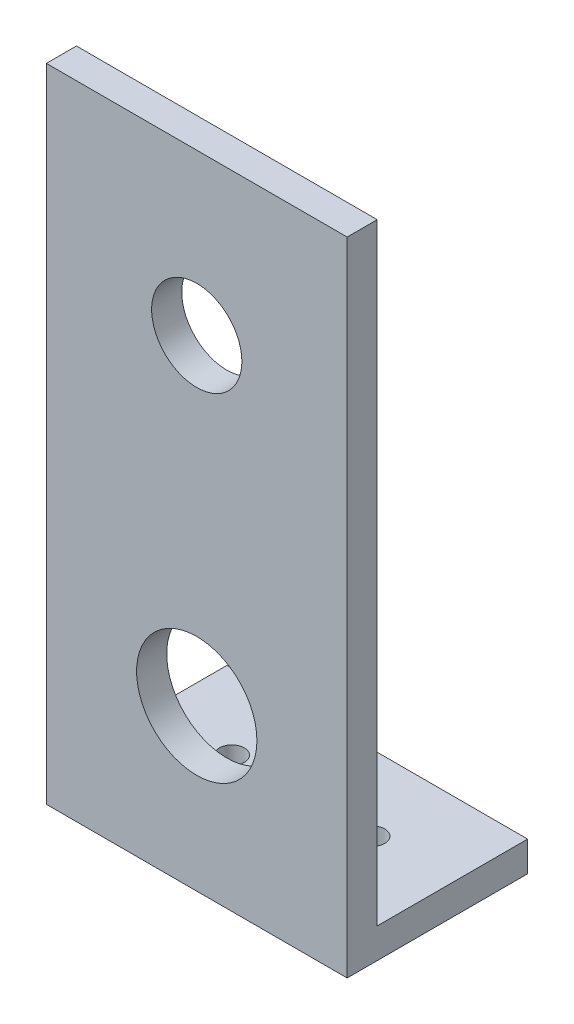
ISO-10303-21;
HEADER;
FILE_DESCRIPTION(('STEP AP214'),'2;1');
FILE_NAME('part.step','',(''),(''),'','','');
FILE_SCHEMA(('AUTOMOTIVE_DESIGN { 1 0 10303 214 1 1 1 1 }'));
ENDSEC;
DATA;
#1=APPLICATION_CONTEXT('core data for automotive mechanical design processes');
#2=APPLICATION_PROTOCOL_DEFINITION('international standard','automotive_design',2000,#1);
#3=PRODUCT_CONTEXT('',#1,'mechanical');
#4=PRODUCT('Part','Part','',(#3));
#5=PRODUCT_RELATED_PRODUCT_CATEGORY('part','',(#4));
#6=PRODUCT_DEFINITION_FORMATION('','',#4);
#7=PRODUCT_DEFINITION_CONTEXT('part definition',#1,'design');
#8=PRODUCT_DEFINITION('design','',#6,#7);
#9=PRODUCT_DEFINITION_SHAPE('','',#8);
#10=(LENGTH_UNIT() NAMED_UNIT(*) SI_UNIT(.MILLI.,.METRE.));
#11=(NAMED_UNIT(*) PLANE_ANGLE_UNIT() SI_UNIT($,.RADIAN.));
#12=(NAMED_UNIT(*) SI_UNIT($,.STERADIAN.) SOLID_ANGLE_UNIT());
#13=UNCERTAINTY_MEASURE_WITH_UNIT(LENGTH_MEASURE(1.E-05),#10,'distance_accuracy_value','');
#14=(GEOMETRIC_REPRESENTATION_CONTEXT(3) GLOBAL_UNCERTAINTY_ASSIGNED_CONTEXT((#13)) GLOBAL_UNIT_ASSIGNED_CONTEXT((#10,
#11,#12)) REPRESENTATION_CONTEXT('',''));
#15=CARTESIAN_POINT('',(0.,0.,0.));
#16=DIRECTION('',(0.,0.,1.));
#17=DIRECTION('',(1.,0.,0.));
#18=AXIS2_PLACEMENT_3D('',#15,#16,#17);
#19=CARTESIAN_POINT('',(-31.8013727121464,-25.7813597707525,3.));
#20=DIRECTION('',(1.,0.,0.));
#21=DIRECTION('',(0.,0.,-1.));
#22=AXIS2_PLACEMENT_3D('',#19,#20,#21);
#23=PLANE('',#22);
#24=DIRECTION('',(0.,-1.,0.));
#25=VECTOR('',#24,1.);
#26=CARTESIAN_POINT('',(-31.8013727121464,-25.7813597707525,0.));
#27=LINE('',#26,#25);
#28=CARTESIAN_POINT('',(-31.8013727121464,38.2186402292475,0.));
#29=VERTEX_POINT('',#28);
#30=CARTESIAN_POINT('',(-31.8013727121464,-22.7813597707525,0.));
#31=VERTEX_POINT('',#30);
#32=EDGE_CURVE('E150',#29,#31,#27,.T.);
#33=ORIENTED_EDGE('',*,*,#32,.T.);
#34=DIRECTION('',(0.,0.,1.));
#35=VECTOR('',#34,1.);
#36=CARTESIAN_POINT('',(-31.8013727121464,-22.7813597707525,-15.));
#37=LINE('',#36,#35);
#38=CARTESIAN_POINT('',(-31.8013727121464,-22.7813597707525,-15.));
#39=VERTEX_POINT('',#38);
#40=EDGE_CURVE('E135',#39,#31,#37,.T.);
#41=ORIENTED_EDGE('',*,*,#40,.F.);
#42=DIRECTION('',(0.,1.,0.));
#43=VECTOR('',#42,1.);
#44=CARTESIAN_POINT('',(-31.8013727121464,-25.7813597707525,-15.));
#45=LINE('',#44,#43);
#46=CARTESIAN_POINT('',(-31.8013727121464,-25.7813597707525,-15.));
#47=VERTEX_POINT('',#46);
#48=EDGE_CURVE('E110',#47,#39,#45,.T.);
#49=ORIENTED_EDGE('',*,*,#48,.F.);
#50=DIRECTION('',(0.,0.,-1.));
#51=VECTOR('',#50,1.);
#52=CARTESIAN_POINT('',(-31.8013727121464,-25.7813597707525,3.));
#53=LINE('',#52,#51);
#54=CARTESIAN_POINT('',(-31.8013727121464,-25.7813597707525,3.));
#55=VERTEX_POINT('',#54);
#56=EDGE_CURVE('E11',#55,#47,#53,.T.);
#57=ORIENTED_EDGE('',*,*,#56,.F.);
#58=DIRECTION('',(0.,-1.,0.));
#59=VECTOR('',#58,1.);
#60=CARTESIAN_POINT('',(-31.8013727121464,-25.7813597707525,3.));
#61=LINE('',#60,#59);
#62=CARTESIAN_POINT('',(-31.8013727121464,38.2186402292475,3.));
#63=VERTEX_POINT('',#62);
#64=EDGE_CURVE('E153',#63,#55,#61,.T.);
#65=ORIENTED_EDGE('',*,*,#64,.F.);
#66=DIRECTION('',(0.,0.,-1.));
#67=VECTOR('',#66,1.);
#68=CARTESIAN_POINT('',(-31.8013727121464,38.2186402292475,3.));
#69=LINE('',#68,#67);
#70=EDGE_CURVE('E158',#63,#29,#69,.T.);
#71=ORIENTED_EDGE('',*,*,#70,.T.);
#72=EDGE_LOOP('',(#33,#41,#49,#57,#65,#71));
#73=FACE_BOUND('',#72,.T.);
#74=ADVANCED_FACE('F32',(#73),#23,.F.);
#75=CARTESIAN_POINT('',(-31.8013727121464,-25.7813597707525,3.));
#76=DIRECTION('',(0.,1.,0.));
#77=DIRECTION('',(0.,0.,1.));
#78=AXIS2_PLACEMENT_3D('',#75,#76,#77);
#79=PLANE('',#78);
#80=CARTESIAN_POINT('',(-23.8013727121464,-25.7813597707525,-7.5));
#81=DIRECTION('',(0.,1.,0.));
#82=DIRECTION('',(0.,0.,1.));
#83=AXIS2_PLACEMENT_3D('',#80,#81,#82);
#84=CIRCLE('',#83,1.25);
#85=CARTESIAN_POINT('',(-23.8013727121464,-25.7813597707525,-6.25));
#86=VERTEX_POINT('',#85);
#87=EDGE_CURVE('E194',#86,#86,#84,.T.);
#88=ORIENTED_EDGE('',*,*,#87,.T.);
#89=EDGE_LOOP('',(#88));
#90=FACE_BOUND('',#89,.T.);
#91=CARTESIAN_POINT('',(-9.80137271214645,-25.7813597707525,-7.5));
#92=DIRECTION('',(0.,1.,0.));
#93=DIRECTION('',(0.,0.,1.));
#94=AXIS2_PLACEMENT_3D('',#91,#92,#93);
#95=CIRCLE('',#94,1.25);
#96=CARTESIAN_POINT('',(-9.80137271214645,-25.7813597707525,-6.25));
#97=VERTEX_POINT('',#96);
#98=EDGE_CURVE('E117',#97,#97,#95,.T.);
#99=ORIENTED_EDGE('',*,*,#98,.T.);
#100=EDGE_LOOP('',(#99));
#101=FACE_BOUND('',#100,.T.);
#102=ORIENTED_EDGE('',*,*,#56,.T.);
#103=DIRECTION('',(-1.,0.,0.));
#104=VECTOR('',#103,1.);
#105=CARTESIAN_POINT('',(-1.80137271214645,-25.7813597707525,-15.));
#106=LINE('',#105,#104);
#107=CARTESIAN_POINT('',(-1.80137271214645,-25.7813597707525,-15.));
#108=VERTEX_POINT('',#107);
#109=EDGE_CURVE('E105',#108,#47,#106,.T.);
#110=ORIENTED_EDGE('',*,*,#109,.F.);
#111=DIRECTION('',(0.,0.,-1.));
#112=VECTOR('',#111,1.);
#113=CARTESIAN_POINT('',(-1.80137271214645,-25.7813597707525,3.));
#114=LINE('',#113,#112);
#115=CARTESIAN_POINT('',(-1.80137271214645,-25.7813597707525,3.));
#116=VERTEX_POINT('',#115);
#117=EDGE_CURVE('E40',#116,#108,#114,.T.);
#118=ORIENTED_EDGE('',*,*,#117,.F.);
#119=DIRECTION('',(1.,0.,0.));
#120=VECTOR('',#119,1.);
#121=CARTESIAN_POINT('',(-31.8013727121464,-25.7813597707525,3.));
#122=LINE('',#121,#120);
#123=EDGE_CURVE('E79',#55,#116,#122,.T.);
#124=ORIENTED_EDGE('',*,*,#123,.F.);
#125=EDGE_LOOP('',(#102,#110,#118,#124));
#126=FACE_BOUND('',#125,.T.);
#127=ADVANCED_FACE('F106',(#90,#101,#126),#79,.F.);
#128=CARTESIAN_POINT('',(-1.80137271214645,-25.7813597707525,3.));
#129=DIRECTION('',(-1.,0.,0.));
#130=DIRECTION('',(0.,0.,1.));
#131=AXIS2_PLACEMENT_3D('',#128,#129,#130);
#132=PLANE('',#131);
#133=ORIENTED_EDGE('',*,*,#117,.T.);
#134=DIRECTION('',(0.,-1.,0.));
#135=VECTOR('',#134,1.);
#136=CARTESIAN_POINT('',(-1.80137271214645,-25.7813597707525,-15.));
#137=LINE('',#136,#135);
#138=CARTESIAN_POINT('',(-1.80137271214645,-22.7813597707525,-15.));
#139=VERTEX_POINT('',#138);
#140=EDGE_CURVE('E99',#139,#108,#137,.T.);
#141=ORIENTED_EDGE('',*,*,#140,.F.);
#142=DIRECTION('',(0.,0.,1.));
#143=VECTOR('',#142,1.);
#144=CARTESIAN_POINT('',(-1.80137271214645,-22.7813597707525,-15.));
#145=LINE('',#144,#143);
#146=CARTESIAN_POINT('',(-1.80137271214645,-22.7813597707525,0.));
#147=VERTEX_POINT('',#146);
#148=EDGE_CURVE('E124',#139,#147,#145,.T.);
#149=ORIENTED_EDGE('',*,*,#148,.T.);
#150=DIRECTION('',(0.,1.,0.));
#151=VECTOR('',#150,1.);
#152=CARTESIAN_POINT('',(-1.80137271214645,-25.7813597707525,0.));
#153=LINE('',#152,#151);
#154=CARTESIAN_POINT('',(-1.80137271214645,38.2186402292475,0.));
#155=VERTEX_POINT('',#154);
#156=EDGE_CURVE('E131',#147,#155,#153,.T.);
#157=ORIENTED_EDGE('',*,*,#156,.T.);
#158=DIRECTION('',(0.,0.,-1.));
#159=VECTOR('',#158,1.);
#160=CARTESIAN_POINT('',(-1.80137271214645,38.2186402292475,3.));
#161=LINE('',#160,#159);
#162=CARTESIAN_POINT('',(-1.80137271214645,38.2186402292475,3.));
#163=VERTEX_POINT('',#162);
#164=EDGE_CURVE('E102',#163,#155,#161,.T.);
#165=ORIENTED_EDGE('',*,*,#164,.F.);
#166=DIRECTION('',(0.,1.,0.));
#167=VECTOR('',#166,1.);
#168=CARTESIAN_POINT('',(-1.80137271214645,-25.7813597707525,3.));
#169=LINE('',#168,#167);
#170=EDGE_CURVE('E101',#116,#163,#169,.T.);
#171=ORIENTED_EDGE('',*,*,#170,.F.);
#172=EDGE_LOOP('',(#133,#141,#149,#157,#165,#171));
#173=FACE_BOUND('',#172,.T.);
#174=ADVANCED_FACE('F96',(#173),#132,.F.);
#175=CARTESIAN_POINT('',(-31.8013727121464,38.2186402292475,3.));
#176=DIRECTION('',(0.,-1.,0.));
#177=DIRECTION('',(0.,0.,-1.));
#178=AXIS2_PLACEMENT_3D('',#175,#176,#177);
#179=PLANE('',#178);
#180=DIRECTION('',(-1.,0.,0.));
#181=VECTOR('',#180,1.);
#182=CARTESIAN_POINT('',(-31.8013727121464,38.2186402292475,0.));
#183=LINE('',#182,#181);
#184=EDGE_CURVE('E72',#155,#29,#183,.T.);
#185=ORIENTED_EDGE('',*,*,#184,.T.);
#186=ORIENTED_EDGE('',*,*,#70,.F.);
#187=DIRECTION('',(-1.,0.,0.));
#188=VECTOR('',#187,1.);
#189=CARTESIAN_POINT('',(-31.8013727121464,38.2186402292475,3.));
#190=LINE('',#189,#188);
#191=EDGE_CURVE('E57',#163,#63,#190,.T.);
#192=ORIENTED_EDGE('',*,*,#191,.F.);
#193=ORIENTED_EDGE('',*,*,#164,.T.);
#194=EDGE_LOOP('',(#185,#186,#192,#193));
#195=FACE_BOUND('',#194,.T.);
#196=ADVANCED_FACE('F164',(#195),#179,.F.);
#197=CARTESIAN_POINT('',(0.,0.,3.));
#198=DIRECTION('',(0.,0.,-1.));
#199=DIRECTION('',(-1.,0.,0.));
#200=AXIS2_PLACEMENT_3D('',#197,#198,#199);
#201=PLANE('',#200);
#202=CARTESIAN_POINT('',(-16.8013727121464,-9.78135977075245,3.));
#203=DIRECTION('',(0.,0.,1.));
#204=DIRECTION('',(1.,0.,0.));
#205=AXIS2_PLACEMENT_3D('',#202,#203,#204);
#206=CIRCLE('',#205,6.);
#207=CARTESIAN_POINT('',(-10.8013727121464,-9.78135977075245,3.));
#208=VERTEX_POINT('',#207);
#209=EDGE_CURVE('E138',#208,#208,#206,.T.);
#210=ORIENTED_EDGE('',*,*,#209,.F.);
#211=EDGE_LOOP('',(#210));
#212=FACE_BOUND('',#211,.T.);
#213=CARTESIAN_POINT('',(-16.8013727121464,22.2186402292475,3.));
#214=DIRECTION('',(0.,0.,1.));
#215=DIRECTION('',(1.,0.,0.));
#216=AXIS2_PLACEMENT_3D('',#213,#214,#215);
#217=CIRCLE('',#216,4.5);
#218=CARTESIAN_POINT('',(-12.3013727121464,22.2186402292475,3.));
#219=VERTEX_POINT('',#218);
#220=EDGE_CURVE('E145',#219,#219,#217,.T.);
#221=ORIENTED_EDGE('',*,*,#220,.F.);
#222=EDGE_LOOP('',(#221));
#223=FACE_BOUND('',#222,.T.);
#224=ORIENTED_EDGE('',*,*,#64,.T.);
#225=ORIENTED_EDGE('',*,*,#123,.T.);
#226=ORIENTED_EDGE('',*,*,#170,.T.);
#227=ORIENTED_EDGE('',*,*,#191,.T.);
#228=EDGE_LOOP('',(#224,#225,#226,#227));
#229=FACE_BOUND('',#228,.T.);
#230=ADVANCED_FACE('F169',(#212,#223,#229),#201,.F.);
#231=CARTESIAN_POINT('',(0.,0.,0.));
#232=DIRECTION('',(0.,0.,-1.));
#233=DIRECTION('',(-1.,0.,0.));
#234=AXIS2_PLACEMENT_3D('',#231,#232,#233);
#235=PLANE('',#234);
#236=DIRECTION('',(1.,0.,0.));
#237=VECTOR('',#236,1.);
#238=CARTESIAN_POINT('',(-1.80137271214645,-22.7813597707525,0.));
#239=LINE('',#238,#237);
#240=EDGE_CURVE('E48',#31,#147,#239,.T.);
#241=ORIENTED_EDGE('',*,*,#240,.F.);
#242=ORIENTED_EDGE('',*,*,#32,.F.);
#243=ORIENTED_EDGE('',*,*,#184,.F.);
#244=ORIENTED_EDGE('',*,*,#156,.F.);
#245=EDGE_LOOP('',(#241,#242,#243,#244));
#246=FACE_BOUND('',#245,.T.);
#247=CARTESIAN_POINT('',(-16.8013727121464,-9.78135977075245,0.));
#248=DIRECTION('',(0.,0.,1.));
#249=DIRECTION('',(1.,0.,0.));
#250=AXIS2_PLACEMENT_3D('',#247,#248,#249);
#251=CIRCLE('',#250,6.);
#252=CARTESIAN_POINT('',(-10.8013727121464,-9.78135977075245,0.));
#253=VERTEX_POINT('',#252);
#254=EDGE_CURVE('E127',#253,#253,#251,.T.);
#255=ORIENTED_EDGE('',*,*,#254,.T.);
#256=EDGE_LOOP('',(#255));
#257=FACE_BOUND('',#256,.T.);
#258=CARTESIAN_POINT('',(-16.8013727121464,22.2186402292475,0.));
#259=DIRECTION('',(0.,0.,1.));
#260=DIRECTION('',(1.,0.,0.));
#261=AXIS2_PLACEMENT_3D('',#258,#259,#260);
#262=CIRCLE('',#261,4.5);
#263=CARTESIAN_POINT('',(-12.3013727121464,22.2186402292475,0.));
#264=VERTEX_POINT('',#263);
#265=EDGE_CURVE('E147',#264,#264,#262,.T.);
#266=ORIENTED_EDGE('',*,*,#265,.T.);
#267=EDGE_LOOP('',(#266));
#268=FACE_BOUND('',#267,.T.);
#269=ADVANCED_FACE('F165',(#246,#257,#268),#235,.T.);
#270=CARTESIAN_POINT('',(-16.8013727121464,22.2186402292475,0.));
#271=DIRECTION('',(0.,0.,1.));
#272=DIRECTION('',(1.,0.,0.));
#273=AXIS2_PLACEMENT_3D('',#270,#271,#272);
#274=CYLINDRICAL_SURFACE('',#273,4.5);
#275=ORIENTED_EDGE('',*,*,#265,.F.);
#276=EDGE_LOOP('',(#275));
#277=FACE_BOUND('',#276,.T.);
#278=ORIENTED_EDGE('',*,*,#220,.T.);
#279=EDGE_LOOP('',(#278));
#280=FACE_BOUND('',#279,.T.);
#281=ADVANCED_FACE('F177',(#277,#280),#274,.F.);
#282=CARTESIAN_POINT('',(-16.8013727121464,-9.78135977075245,0.));
#283=DIRECTION('',(0.,0.,1.));
#284=DIRECTION('',(1.,0.,0.));
#285=AXIS2_PLACEMENT_3D('',#282,#283,#284);
#286=CYLINDRICAL_SURFACE('',#285,6.);
#287=ORIENTED_EDGE('',*,*,#254,.F.);
#288=EDGE_LOOP('',(#287));
#289=FACE_BOUND('',#288,.T.);
#290=ORIENTED_EDGE('',*,*,#209,.T.);
#291=EDGE_LOOP('',(#290));
#292=FACE_BOUND('',#291,.T.);
#293=ADVANCED_FACE('F214',(#289,#292),#286,.F.);
#294=CARTESIAN_POINT('',(-1.80137271214645,-22.7813597707525,-15.));
#295=DIRECTION('',(0.,-1.,0.));
#296=DIRECTION('',(0.,0.,-1.));
#297=AXIS2_PLACEMENT_3D('',#294,#295,#296);
#298=PLANE('',#297);
#299=CARTESIAN_POINT('',(-23.8013727121464,-22.7813597707525,-7.5));
#300=DIRECTION('',(0.,1.,0.));
#301=DIRECTION('',(0.,0.,1.));
#302=AXIS2_PLACEMENT_3D('',#299,#300,#301);
#303=CIRCLE('',#302,1.25);
#304=CARTESIAN_POINT('',(-23.8013727121464,-22.7813597707525,-6.25));
#305=VERTEX_POINT('',#304);
#306=EDGE_CURVE('E202',#305,#305,#303,.T.);
#307=ORIENTED_EDGE('',*,*,#306,.F.);
#308=EDGE_LOOP('',(#307));
#309=FACE_BOUND('',#308,.T.);
#310=CARTESIAN_POINT('',(-9.80137271214645,-22.7813597707525,-7.5));
#311=DIRECTION('',(0.,1.,0.));
#312=DIRECTION('',(0.,0.,1.));
#313=AXIS2_PLACEMENT_3D('',#310,#311,#312);
#314=CIRCLE('',#313,1.25);
#315=CARTESIAN_POINT('',(-9.80137271214645,-22.7813597707525,-6.25));
#316=VERTEX_POINT('',#315);
#317=EDGE_CURVE('E198',#316,#316,#314,.T.);
#318=ORIENTED_EDGE('',*,*,#317,.F.);
#319=EDGE_LOOP('',(#318));
#320=FACE_BOUND('',#319,.T.);
#321=ORIENTED_EDGE('',*,*,#240,.T.);
#322=ORIENTED_EDGE('',*,*,#148,.F.);
#323=DIRECTION('',(1.,0.,0.));
#324=VECTOR('',#323,1.);
#325=CARTESIAN_POINT('',(-1.80137271214645,-22.7813597707525,-15.));
#326=LINE('',#325,#324);
#327=EDGE_CURVE('E114',#39,#139,#326,.T.);
#328=ORIENTED_EDGE('',*,*,#327,.F.);
#329=ORIENTED_EDGE('',*,*,#40,.T.);
#330=EDGE_LOOP('',(#321,#322,#328,#329));
#331=FACE_BOUND('',#330,.T.);
#332=ADVANCED_FACE('F211',(#309,#320,#331),#298,.F.);
#333=CARTESIAN_POINT('',(0.,0.,-15.));
#334=DIRECTION('',(0.,0.,1.));
#335=DIRECTION('',(1.,0.,0.));
#336=AXIS2_PLACEMENT_3D('',#333,#334,#335);
#337=PLANE('',#336);
#338=ORIENTED_EDGE('',*,*,#140,.T.);
#339=ORIENTED_EDGE('',*,*,#109,.T.);
#340=ORIENTED_EDGE('',*,*,#48,.T.);
#341=ORIENTED_EDGE('',*,*,#327,.T.);
#342=EDGE_LOOP('',(#338,#339,#340,#341));
#343=FACE_BOUND('',#342,.T.);
#344=ADVANCED_FACE('F112',(#343),#337,.F.);
#345=CARTESIAN_POINT('',(-9.80137271214645,-37.7813597707524,-7.5));
#346=DIRECTION('',(0.,1.,0.));
#347=DIRECTION('',(0.,0.,1.));
#348=AXIS2_PLACEMENT_3D('',#345,#346,#347);
#349=CYLINDRICAL_SURFACE('',#348,1.25);
#350=ORIENTED_EDGE('',*,*,#317,.T.);
#351=EDGE_LOOP('',(#350));
#352=FACE_BOUND('',#351,.T.);
#353=ORIENTED_EDGE('',*,*,#98,.F.);
#354=EDGE_LOOP('',(#353));
#355=FACE_BOUND('',#354,.T.);
#356=ADVANCED_FACE('F220',(#352,#355),#349,.F.);
#357=CARTESIAN_POINT('',(-23.8013727121464,-37.7813597707524,-7.5));
#358=DIRECTION('',(0.,1.,0.));
#359=DIRECTION('',(0.,0.,1.));
#360=AXIS2_PLACEMENT_3D('',#357,#358,#359);
#361=CYLINDRICAL_SURFACE('',#360,1.25);
#362=ORIENTED_EDGE('',*,*,#306,.T.);
#363=EDGE_LOOP('',(#362));
#364=FACE_BOUND('',#363,.T.);
#365=ORIENTED_EDGE('',*,*,#87,.F.);
#366=EDGE_LOOP('',(#365));
#367=FACE_BOUND('',#366,.T.);
#368=ADVANCED_FACE('F208',(#364,#367),#361,.F.);
#369=CLOSED_SHELL('',(#74,#127,#174,#196,#230,#269,#281,#293,#332,#344,#356,#368));
#370=MANIFOLD_SOLID_BREP('B2',#369);
#371=ADVANCED_BREP_SHAPE_REPRESENTATION('',(#18,#370),#14);
#372=SHAPE_DEFINITION_REPRESENTATION(#9,#371);
ENDSEC;
END-ISO-10303-21;
